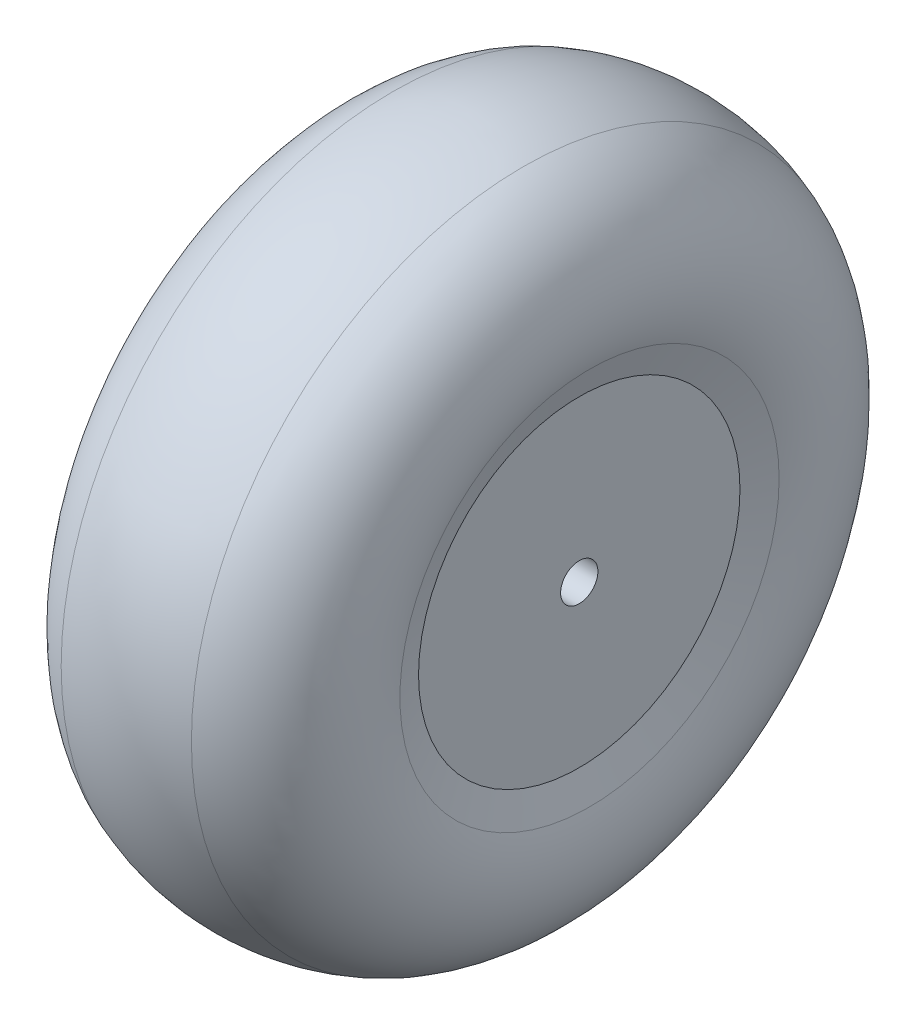
ISO-10303-21;
HEADER;
FILE_DESCRIPTION(('STEP AP214'),'2;1');
FILE_NAME('part.step','',(''),(''),'','','');
FILE_SCHEMA(('AUTOMOTIVE_DESIGN { 1 0 10303 214 1 1 1 1 }'));
ENDSEC;
DATA;
#1=APPLICATION_CONTEXT('core data for automotive mechanical design processes');
#2=APPLICATION_PROTOCOL_DEFINITION('international standard','automotive_design',2000,#1);
#3=PRODUCT_CONTEXT('',#1,'mechanical');
#4=PRODUCT('Part','Part','',(#3));
#5=PRODUCT_RELATED_PRODUCT_CATEGORY('part','',(#4));
#6=PRODUCT_DEFINITION_FORMATION('','',#4);
#7=PRODUCT_DEFINITION_CONTEXT('part definition',#1,'design');
#8=PRODUCT_DEFINITION('design','',#6,#7);
#9=PRODUCT_DEFINITION_SHAPE('','',#8);
#10=(LENGTH_UNIT() NAMED_UNIT(*) SI_UNIT(.MILLI.,.METRE.));
#11=(NAMED_UNIT(*) PLANE_ANGLE_UNIT() SI_UNIT($,.RADIAN.));
#12=(NAMED_UNIT(*) SI_UNIT($,.STERADIAN.) SOLID_ANGLE_UNIT());
#13=UNCERTAINTY_MEASURE_WITH_UNIT(LENGTH_MEASURE(1.E-05),#10,'distance_accuracy_value','');
#14=(GEOMETRIC_REPRESENTATION_CONTEXT(3) GLOBAL_UNCERTAINTY_ASSIGNED_CONTEXT((#13)) GLOBAL_UNIT_ASSIGNED_CONTEXT((#10,
#11,#12)) REPRESENTATION_CONTEXT('',''));
#15=CARTESIAN_POINT('',(0.,0.,0.));
#16=DIRECTION('',(0.,0.,1.));
#17=DIRECTION('',(1.,0.,0.));
#18=AXIS2_PLACEMENT_3D('',#15,#16,#17);
#19=CARTESIAN_POINT('',(26.,0.,0.));
#20=DIRECTION('',(1.,0.,0.));
#21=DIRECTION('',(0.,0.,-1.));
#22=AXIS2_PLACEMENT_3D('',#19,#20,#21);
#23=PLANE('',#22);
#24=CARTESIAN_POINT('',(26.,0.,0.));
#25=DIRECTION('',(1.,0.,0.));
#26=DIRECTION('',(0.,0.,-1.));
#27=AXIS2_PLACEMENT_3D('',#24,#25,#26);
#28=CIRCLE('',#27,2.);
#29=CARTESIAN_POINT('',(26.,0.,-2.));
#30=VERTEX_POINT('',#29);
#31=EDGE_CURVE('E75',#30,#30,#28,.T.);
#32=ORIENTED_EDGE('',*,*,#31,.F.);
#33=EDGE_LOOP('',(#32));
#34=FACE_BOUND('',#33,.T.);
#35=CARTESIAN_POINT('',(26.,0.,0.));
#36=DIRECTION('',(-1.,0.,0.));
#37=DIRECTION('',(0.,0.,1.));
#38=AXIS2_PLACEMENT_3D('',#35,#36,#37);
#39=CIRCLE('',#38,17.25);
#40=CARTESIAN_POINT('',(26.,0.,17.25));
#41=VERTEX_POINT('',#40);
#42=EDGE_CURVE('E71',#41,#41,#39,.T.);
#43=ORIENTED_EDGE('',*,*,#42,.F.);
#44=EDGE_LOOP('',(#43));
#45=FACE_BOUND('',#44,.T.);
#46=ADVANCED_FACE('F43',(#34,#45),#23,.T.);
#47=CARTESIAN_POINT('',(-4.62270399556512,0.,0.));
#48=DIRECTION('',(-1.,0.,0.));
#49=DIRECTION('',(0.,0.,1.));
#50=AXIS2_PLACEMENT_3D('',#47,#48,#49);
#51=CONICAL_SURFACE('',#50,30.25,1.22914793628512);
#52=CARTESIAN_POINT('',(-1.10172947233722,0.,0.));
#53=DIRECTION('',(-1.,0.,0.));
#54=DIRECTION('',(0.,0.,1.));
#55=AXIS2_PLACEMENT_3D('',#52,#53,#54);
#56=CIRCLE('',#55,20.3482912066454);
#57=CARTESIAN_POINT('',(-1.10172947233722,0.,20.3482912066454));
#58=VERTEX_POINT('',#57);
#59=EDGE_CURVE('E61',#58,#58,#56,.T.);
#60=ORIENTED_EDGE('',*,*,#59,.T.);
#61=EDGE_LOOP('',(#60));
#62=FACE_BOUND('',#61,.T.);
#63=CARTESIAN_POINT('',(0.,0.,0.));
#64=DIRECTION('',(1.,0.,0.));
#65=DIRECTION('',(0.,0.,-1.));
#66=AXIS2_PLACEMENT_3D('',#63,#64,#65);
#67=CIRCLE('',#66,17.25);
#68=CARTESIAN_POINT('',(0.,0.,-17.25));
#69=VERTEX_POINT('',#68);
#70=EDGE_CURVE('E67',#69,#69,#67,.T.);
#71=ORIENTED_EDGE('',*,*,#70,.T.);
#72=EDGE_LOOP('',(#71));
#73=FACE_BOUND('',#72,.T.);
#74=ADVANCED_FACE('F94',(#62,#73),#51,.F.);
#75=CARTESIAN_POINT('',(26.,0.,0.));
#76=DIRECTION('',(1.,0.,0.));
#77=DIRECTION('',(0.,0.,-1.));
#78=AXIS2_PLACEMENT_3D('',#75,#76,#77);
#79=CONICAL_SURFACE('',#78,17.25,1.22914793628513);
#80=CARTESIAN_POINT('',(27.1017294723372,0.,0.));
#81=DIRECTION('',(1.,0.,0.));
#82=DIRECTION('',(0.,0.,-1.));
#83=AXIS2_PLACEMENT_3D('',#80,#81,#82);
#84=CIRCLE('',#83,20.3482912066454);
#85=CARTESIAN_POINT('',(27.1017294723372,0.,-20.3482912066454));
#86=VERTEX_POINT('',#85);
#87=EDGE_CURVE('E10',#86,#86,#84,.T.);
#88=ORIENTED_EDGE('',*,*,#87,.T.);
#89=EDGE_LOOP('',(#88));
#90=FACE_BOUND('',#89,.T.);
#91=ORIENTED_EDGE('',*,*,#42,.T.);
#92=EDGE_LOOP('',(#91));
#93=FACE_BOUND('',#92,.T.);
#94=ADVANCED_FACE('F90',(#90,#93),#79,.F.);
#95=CARTESIAN_POINT('',(0.,0.,0.));
#96=DIRECTION('',(1.,0.,0.));
#97=DIRECTION('',(0.,0.,-1.));
#98=AXIS2_PLACEMENT_3D('',#95,#96,#97);
#99=PLANE('',#98);
#100=CARTESIAN_POINT('',(0.,0.,0.));
#101=DIRECTION('',(-1.,0.,0.));
#102=DIRECTION('',(0.,0.,1.));
#103=AXIS2_PLACEMENT_3D('',#100,#101,#102);
#104=CIRCLE('',#103,2.);
#105=CARTESIAN_POINT('',(0.,0.,2.));
#106=VERTEX_POINT('',#105);
#107=EDGE_CURVE('E79',#106,#106,#104,.T.);
#108=ORIENTED_EDGE('',*,*,#107,.F.);
#109=EDGE_LOOP('',(#108));
#110=FACE_BOUND('',#109,.T.);
#111=ORIENTED_EDGE('',*,*,#70,.F.);
#112=EDGE_LOOP('',(#111));
#113=FACE_BOUND('',#112,.T.);
#114=ADVANCED_FACE('F86',(#110,#113),#99,.F.);
#115=CARTESIAN_POINT('',(13.,0.,0.));
#116=DIRECTION('',(1.,0.,0.));
#117=DIRECTION('',(0.,0.,-1.));
#118=AXIS2_PLACEMENT_3D('',#115,#116,#117);
#119=DEGENERATE_TOROIDAL_SURFACE('',#118,16.8730217866008,20.,.T.);
#120=CARTESIAN_POINT('',(6.01178635907871,0.,0.));
#121=DIRECTION('',(1.,0.,0.));
#122=DIRECTION('',(0.,0.,-1.));
#123=AXIS2_PLACEMENT_3D('',#120,#121,#122);
#124=CIRCLE('',#123,35.6124153229147);
#125=CARTESIAN_POINT('',(6.01178635907871,0.,-35.6124153229147));
#126=VERTEX_POINT('',#125);
#127=EDGE_CURVE('E51',#126,#126,#124,.T.);
#128=ORIENTED_EDGE('',*,*,#127,.T.);
#129=EDGE_LOOP('',(#128));
#130=FACE_BOUND('',#129,.T.);
#131=CARTESIAN_POINT('',(19.9882136409213,0.,0.));
#132=DIRECTION('',(-1.,0.,0.));
#133=DIRECTION('',(0.,0.,1.));
#134=AXIS2_PLACEMENT_3D('',#131,#132,#133);
#135=CIRCLE('',#134,35.6124153229147);
#136=CARTESIAN_POINT('',(19.9882136409213,0.,35.6124153229147));
#137=VERTEX_POINT('',#136);
#138=EDGE_CURVE('E56',#137,#137,#135,.T.);
#139=ORIENTED_EDGE('',*,*,#138,.T.);
#140=EDGE_LOOP('',(#139));
#141=FACE_BOUND('',#140,.T.);
#142=ADVANCED_FACE('F89',(#130,#141),#119,.T.);
#143=CARTESIAN_POINT('',(10.2047145436315,0.,0.));
#144=DIRECTION('',(1.,0.,0.));
#145=DIRECTION('',(0.,0.,-1.));
#146=AXIS2_PLACEMENT_3D('',#143,#144,#145);
#147=TOROIDAL_SURFACE('',#146,24.3687792011264,12.);
#148=ORIENTED_EDGE('',*,*,#127,.F.);
#149=EDGE_LOOP('',(#148));
#150=FACE_BOUND('',#149,.T.);
#151=ORIENTED_EDGE('',*,*,#59,.F.);
#152=EDGE_LOOP('',(#151));
#153=FACE_BOUND('',#152,.T.);
#154=ADVANCED_FACE('F108',(#150,#153),#147,.T.);
#155=CARTESIAN_POINT('',(15.7952854563685,0.,0.));
#156=DIRECTION('',(1.,0.,0.));
#157=DIRECTION('',(0.,0.,-1.));
#158=AXIS2_PLACEMENT_3D('',#155,#156,#157);
#159=TOROIDAL_SURFACE('',#158,24.3687792011264,12.);
#160=ORIENTED_EDGE('',*,*,#87,.F.);
#161=EDGE_LOOP('',(#160));
#162=FACE_BOUND('',#161,.T.);
#163=ORIENTED_EDGE('',*,*,#138,.F.);
#164=EDGE_LOOP('',(#163));
#165=FACE_BOUND('',#164,.T.);
#166=ADVANCED_FACE('F45',(#162,#165),#159,.T.);
#167=CARTESIAN_POINT('',(27.7952854563685,0.,0.));
#168=DIRECTION('',(-1.,0.,0.));
#169=DIRECTION('',(0.,0.,1.));
#170=AXIS2_PLACEMENT_3D('',#167,#168,#169);
#171=CYLINDRICAL_SURFACE('',#170,2.);
#172=ORIENTED_EDGE('',*,*,#31,.T.);
#173=EDGE_LOOP('',(#172));
#174=FACE_BOUND('',#173,.T.);
#175=ORIENTED_EDGE('',*,*,#107,.T.);
#176=EDGE_LOOP('',(#175));
#177=FACE_BOUND('',#176,.T.);
#178=ADVANCED_FACE('F84',(#174,#177),#171,.F.);
#179=CLOSED_SHELL('',(#46,#74,#94,#114,#142,#154,#166,#178));
#180=MANIFOLD_SOLID_BREP('B2',#179);
#181=ADVANCED_BREP_SHAPE_REPRESENTATION('',(#18,#180),#14);
#182=SHAPE_DEFINITION_REPRESENTATION(#9,#181);
ENDSEC;
END-ISO-10303-21;
